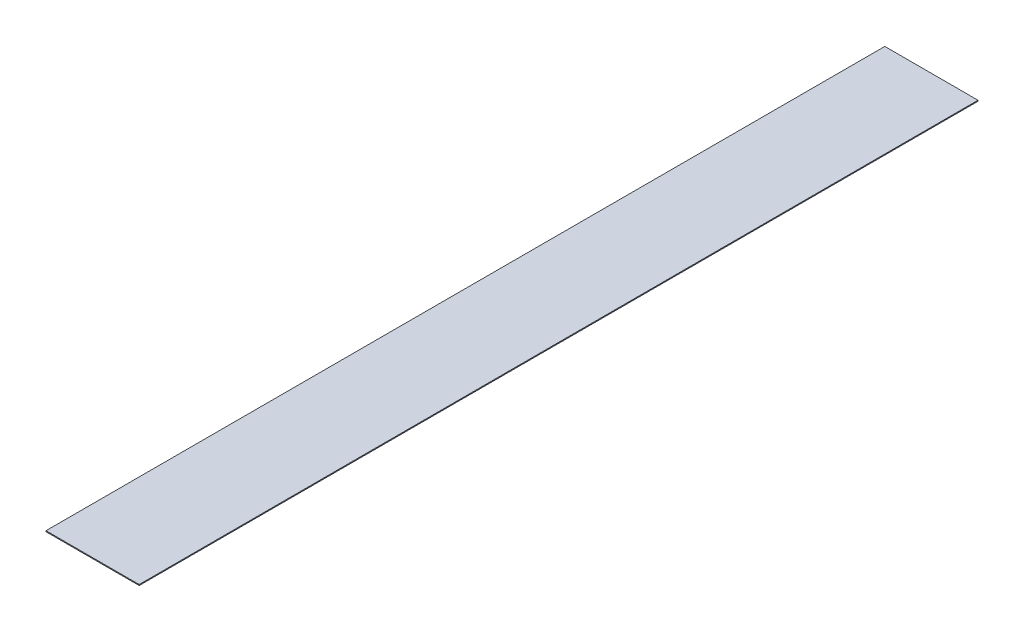
ISO-10303-21;
HEADER;
FILE_DESCRIPTION(('STEP AP214'),'2;1');
FILE_NAME('part.step','',(''),(''),'','','');
FILE_SCHEMA(('AUTOMOTIVE_DESIGN { 1 0 10303 214 1 1 1 1 }'));
ENDSEC;
DATA;
#1=APPLICATION_CONTEXT('core data for automotive mechanical design processes');
#2=APPLICATION_PROTOCOL_DEFINITION('international standard','automotive_design',2000,#1);
#3=PRODUCT_CONTEXT('',#1,'mechanical');
#4=PRODUCT('Part','Part','',(#3));
#5=PRODUCT_RELATED_PRODUCT_CATEGORY('part','',(#4));
#6=PRODUCT_DEFINITION_FORMATION('','',#4);
#7=PRODUCT_DEFINITION_CONTEXT('part definition',#1,'design');
#8=PRODUCT_DEFINITION('design','',#6,#7);
#9=PRODUCT_DEFINITION_SHAPE('','',#8);
#10=(LENGTH_UNIT() NAMED_UNIT(*) SI_UNIT(.MILLI.,.METRE.));
#11=(NAMED_UNIT(*) PLANE_ANGLE_UNIT() SI_UNIT($,.RADIAN.));
#12=(NAMED_UNIT(*) SI_UNIT($,.STERADIAN.) SOLID_ANGLE_UNIT());
#13=UNCERTAINTY_MEASURE_WITH_UNIT(LENGTH_MEASURE(1.E-05),#10,'distance_accuracy_value','');
#14=(GEOMETRIC_REPRESENTATION_CONTEXT(3) GLOBAL_UNCERTAINTY_ASSIGNED_CONTEXT((#13)) GLOBAL_UNIT_ASSIGNED_CONTEXT((#10,
#11,#12)) REPRESENTATION_CONTEXT('',''));
#15=CARTESIAN_POINT('',(0.,0.,0.));
#16=DIRECTION('',(0.,0.,1.));
#17=DIRECTION('',(1.,0.,0.));
#18=AXIS2_PLACEMENT_3D('',#15,#16,#17);
#19=CARTESIAN_POINT('',(-25.4,0.508,0.));
#20=DIRECTION('',(1.,0.,0.));
#21=DIRECTION('',(0.,0.,-1.));
#22=AXIS2_PLACEMENT_3D('',#19,#20,#21);
#23=PLANE('',#22);
#24=DIRECTION('',(0.,0.,1.));
#25=VECTOR('',#24,1.);
#26=CARTESIAN_POINT('',(-25.4,0.,0.));
#27=LINE('',#26,#25);
#28=CARTESIAN_POINT('',(-25.4,0.,-457.2));
#29=VERTEX_POINT('',#28);
#30=CARTESIAN_POINT('',(-25.4,0.,0.));
#31=VERTEX_POINT('',#30);
#32=EDGE_CURVE('E96',#29,#31,#27,.T.);
#33=ORIENTED_EDGE('',*,*,#32,.T.);
#34=DIRECTION('',(0.,-1.,0.));
#35=VECTOR('',#34,1.);
#36=CARTESIAN_POINT('',(-25.4,0.508,0.));
#37=LINE('',#36,#35);
#38=CARTESIAN_POINT('',(-25.4,0.508,0.));
#39=VERTEX_POINT('',#38);
#40=EDGE_CURVE('E11',#39,#31,#37,.T.);
#41=ORIENTED_EDGE('',*,*,#40,.F.);
#42=DIRECTION('',(0.,0.,1.));
#43=VECTOR('',#42,1.);
#44=CARTESIAN_POINT('',(-25.4,0.508,0.));
#45=LINE('',#44,#43);
#46=CARTESIAN_POINT('',(-25.4,0.508,-457.2));
#47=VERTEX_POINT('',#46);
#48=EDGE_CURVE('E84',#47,#39,#45,.T.);
#49=ORIENTED_EDGE('',*,*,#48,.F.);
#50=DIRECTION('',(0.,-1.,0.));
#51=VECTOR('',#50,1.);
#52=CARTESIAN_POINT('',(-25.4,0.508,-457.2));
#53=LINE('',#52,#51);
#54=EDGE_CURVE('E92',#47,#29,#53,.T.);
#55=ORIENTED_EDGE('',*,*,#54,.T.);
#56=EDGE_LOOP('',(#33,#41,#49,#55));
#57=FACE_BOUND('',#56,.T.);
#58=ADVANCED_FACE('F33',(#57),#23,.F.);
#59=CARTESIAN_POINT('',(-25.4,0.508,0.));
#60=DIRECTION('',(0.,0.,-1.));
#61=DIRECTION('',(-1.,0.,0.));
#62=AXIS2_PLACEMENT_3D('',#59,#60,#61);
#63=PLANE('',#62);
#64=DIRECTION('',(1.,0.,0.));
#65=VECTOR('',#64,1.);
#66=CARTESIAN_POINT('',(-25.4,0.,0.));
#67=LINE('',#66,#65);
#68=CARTESIAN_POINT('',(25.4,0.,0.));
#69=VERTEX_POINT('',#68);
#70=EDGE_CURVE('E88',#31,#69,#67,.T.);
#71=ORIENTED_EDGE('',*,*,#70,.T.);
#72=DIRECTION('',(0.,-1.,0.));
#73=VECTOR('',#72,1.);
#74=CARTESIAN_POINT('',(25.4,0.508,0.));
#75=LINE('',#74,#73);
#76=CARTESIAN_POINT('',(25.4,0.508,0.));
#77=VERTEX_POINT('',#76);
#78=EDGE_CURVE('E41',#77,#69,#75,.T.);
#79=ORIENTED_EDGE('',*,*,#78,.F.);
#80=DIRECTION('',(1.,0.,0.));
#81=VECTOR('',#80,1.);
#82=CARTESIAN_POINT('',(-25.4,0.508,0.));
#83=LINE('',#82,#81);
#84=EDGE_CURVE('E79',#39,#77,#83,.T.);
#85=ORIENTED_EDGE('',*,*,#84,.F.);
#86=ORIENTED_EDGE('',*,*,#40,.T.);
#87=EDGE_LOOP('',(#71,#79,#85,#86));
#88=FACE_BOUND('',#87,.T.);
#89=ADVANCED_FACE('F87',(#88),#63,.F.);
#90=CARTESIAN_POINT('',(25.4,0.508,0.));
#91=DIRECTION('',(-1.,0.,0.));
#92=DIRECTION('',(0.,0.,1.));
#93=AXIS2_PLACEMENT_3D('',#90,#91,#92);
#94=PLANE('',#93);
#95=DIRECTION('',(0.,0.,-1.));
#96=VECTOR('',#95,1.);
#97=CARTESIAN_POINT('',(25.4,0.,0.));
#98=LINE('',#97,#96);
#99=CARTESIAN_POINT('',(25.4,0.,-457.2));
#100=VERTEX_POINT('',#99);
#101=EDGE_CURVE('E66',#69,#100,#98,.T.);
#102=ORIENTED_EDGE('',*,*,#101,.T.);
#103=DIRECTION('',(0.,-1.,0.));
#104=VECTOR('',#103,1.);
#105=CARTESIAN_POINT('',(25.4,0.508,-457.2));
#106=LINE('',#105,#104);
#107=CARTESIAN_POINT('',(25.4,0.508,-457.2));
#108=VERTEX_POINT('',#107);
#109=EDGE_CURVE('E89',#108,#100,#106,.T.);
#110=ORIENTED_EDGE('',*,*,#109,.F.);
#111=DIRECTION('',(0.,0.,-1.));
#112=VECTOR('',#111,1.);
#113=CARTESIAN_POINT('',(25.4,0.508,0.));
#114=LINE('',#113,#112);
#115=EDGE_CURVE('E82',#77,#108,#114,.T.);
#116=ORIENTED_EDGE('',*,*,#115,.F.);
#117=ORIENTED_EDGE('',*,*,#78,.T.);
#118=EDGE_LOOP('',(#102,#110,#116,#117));
#119=FACE_BOUND('',#118,.T.);
#120=ADVANCED_FACE('F90',(#119),#94,.F.);
#121=CARTESIAN_POINT('',(-25.4,0.508,-457.2));
#122=DIRECTION('',(0.,0.,1.));
#123=DIRECTION('',(1.,0.,0.));
#124=AXIS2_PLACEMENT_3D('',#121,#122,#123);
#125=PLANE('',#124);
#126=DIRECTION('',(-1.,0.,0.));
#127=VECTOR('',#126,1.);
#128=CARTESIAN_POINT('',(-25.4,0.,-457.2));
#129=LINE('',#128,#127);
#130=EDGE_CURVE('E72',#100,#29,#129,.T.);
#131=ORIENTED_EDGE('',*,*,#130,.T.);
#132=ORIENTED_EDGE('',*,*,#54,.F.);
#133=DIRECTION('',(-1.,0.,0.));
#134=VECTOR('',#133,1.);
#135=CARTESIAN_POINT('',(-25.4,0.508,-457.2));
#136=LINE('',#135,#134);
#137=EDGE_CURVE('E49',#108,#47,#136,.T.);
#138=ORIENTED_EDGE('',*,*,#137,.F.);
#139=ORIENTED_EDGE('',*,*,#109,.T.);
#140=EDGE_LOOP('',(#131,#132,#138,#139));
#141=FACE_BOUND('',#140,.T.);
#142=ADVANCED_FACE('F103',(#141),#125,.F.);
#143=CARTESIAN_POINT('',(0.,0.508,0.));
#144=DIRECTION('',(0.,-1.,0.));
#145=DIRECTION('',(0.,0.,-1.));
#146=AXIS2_PLACEMENT_3D('',#143,#144,#145);
#147=PLANE('',#146);
#148=ORIENTED_EDGE('',*,*,#48,.T.);
#149=ORIENTED_EDGE('',*,*,#84,.T.);
#150=ORIENTED_EDGE('',*,*,#115,.T.);
#151=ORIENTED_EDGE('',*,*,#137,.T.);
#152=EDGE_LOOP('',(#148,#149,#150,#151));
#153=FACE_BOUND('',#152,.T.);
#154=ADVANCED_FACE('F80',(#153),#147,.F.);
#155=CARTESIAN_POINT('',(0.,0.,0.));
#156=DIRECTION('',(0.,-1.,0.));
#157=DIRECTION('',(0.,0.,-1.));
#158=AXIS2_PLACEMENT_3D('',#155,#156,#157);
#159=PLANE('',#158);
#160=ORIENTED_EDGE('',*,*,#32,.F.);
#161=ORIENTED_EDGE('',*,*,#130,.F.);
#162=ORIENTED_EDGE('',*,*,#101,.F.);
#163=ORIENTED_EDGE('',*,*,#70,.F.);
#164=EDGE_LOOP('',(#160,#161,#162,#163));
#165=FACE_BOUND('',#164,.T.);
#166=ADVANCED_FACE('F106',(#165),#159,.T.);
#167=CLOSED_SHELL('',(#58,#89,#120,#142,#154,#166));
#168=MANIFOLD_SOLID_BREP('B2',#167);
#169=ADVANCED_BREP_SHAPE_REPRESENTATION('',(#18,#168),#14);
#170=SHAPE_DEFINITION_REPRESENTATION(#9,#169);
ENDSEC;
END-ISO-10303-21;
